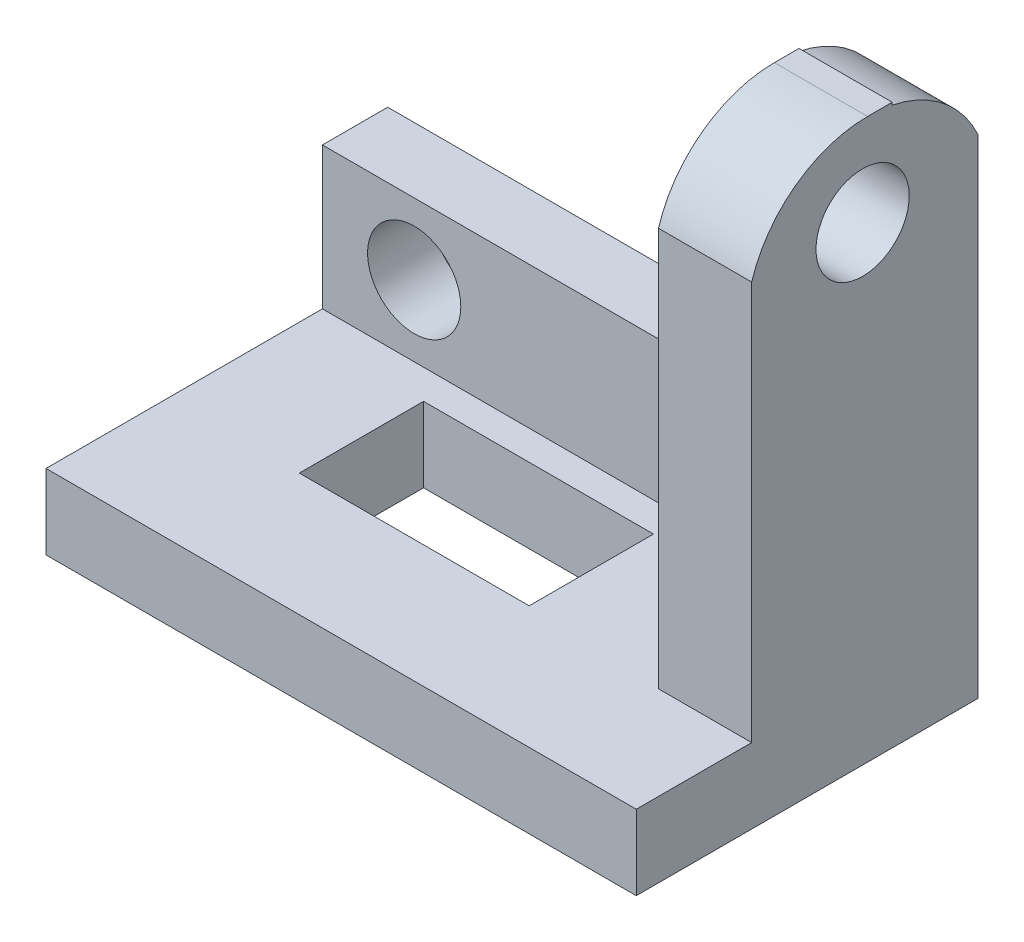
ISO-10303-21;
HEADER;
FILE_DESCRIPTION(('STEP AP214'),'2;1');
FILE_NAME('part.step','',(''),(''),'','','');
FILE_SCHEMA(('AUTOMOTIVE_DESIGN { 1 0 10303 214 1 1 1 1 }'));
ENDSEC;
DATA;
#1=APPLICATION_CONTEXT('core data for automotive mechanical design processes');
#2=APPLICATION_PROTOCOL_DEFINITION('international standard','automotive_design',2000,#1);
#3=PRODUCT_CONTEXT('',#1,'mechanical');
#4=PRODUCT('Part','Part','',(#3));
#5=PRODUCT_RELATED_PRODUCT_CATEGORY('part','',(#4));
#6=PRODUCT_DEFINITION_FORMATION('','',#4);
#7=PRODUCT_DEFINITION_CONTEXT('part definition',#1,'design');
#8=PRODUCT_DEFINITION('design','',#6,#7);
#9=PRODUCT_DEFINITION_SHAPE('','',#8);
#10=(LENGTH_UNIT() NAMED_UNIT(*) SI_UNIT(.MILLI.,.METRE.));
#11=(NAMED_UNIT(*) PLANE_ANGLE_UNIT() SI_UNIT($,.RADIAN.));
#12=(NAMED_UNIT(*) SI_UNIT($,.STERADIAN.) SOLID_ANGLE_UNIT());
#13=UNCERTAINTY_MEASURE_WITH_UNIT(LENGTH_MEASURE(1.E-05),#10,'distance_accuracy_value','');
#14=(GEOMETRIC_REPRESENTATION_CONTEXT(3) GLOBAL_UNCERTAINTY_ASSIGNED_CONTEXT((#13)) GLOBAL_UNIT_ASSIGNED_CONTEXT((#10,
#11,#12)) REPRESENTATION_CONTEXT('',''));
#15=CARTESIAN_POINT('',(0.,0.,0.));
#16=DIRECTION('',(0.,0.,1.));
#17=DIRECTION('',(1.,0.,0.));
#18=AXIS2_PLACEMENT_3D('',#15,#16,#17);
#19=CARTESIAN_POINT('',(0.,0.,0.));
#20=DIRECTION('',(0.,1.,0.));
#21=DIRECTION('',(0.,0.,1.));
#22=AXIS2_PLACEMENT_3D('',#19,#20,#21);
#23=PLANE('',#22);
#24=DIRECTION('',(1.,0.,0.));
#25=VECTOR('',#24,1.);
#26=CARTESIAN_POINT('',(0.,0.,6.71744032632979));
#27=LINE('',#26,#25);
#28=CARTESIAN_POINT('',(41.89111747851,0.,6.71744032632978));
#29=VERTEX_POINT('',#28);
#30=CARTESIAN_POINT('',(56.89111747851,0.,6.71744032632978));
#31=VERTEX_POINT('',#30);
#32=EDGE_CURVE('E340',#29,#31,#27,.T.);
#33=ORIENTED_EDGE('',*,*,#32,.F.);
#34=DIRECTION('',(0.,0.,1.));
#35=VECTOR('',#34,1.);
#36=CARTESIAN_POINT('',(41.89111747851,0.,0.));
#37=LINE('',#36,#35);
#38=CARTESIAN_POINT('',(41.89111747851,0.,10.6759383719178));
#39=VERTEX_POINT('',#38);
#40=EDGE_CURVE('E247',#29,#39,#37,.T.);
#41=ORIENTED_EDGE('',*,*,#40,.T.);
#42=DIRECTION('',(1.,0.,0.));
#43=VECTOR('',#42,1.);
#44=CARTESIAN_POINT('',(-43.10888252149,0.,10.6759383719178));
#45=LINE('',#44,#43);
#46=CARTESIAN_POINT('',(56.89111747851,0.,10.6759383719178));
#47=VERTEX_POINT('',#46);
#48=EDGE_CURVE('E325',#47,#39,#45,.F.);
#49=ORIENTED_EDGE('',*,*,#48,.F.);
#50=DIRECTION('',(0.,0.,-1.));
#51=VECTOR('',#50,1.);
#52=CARTESIAN_POINT('',(56.89111747851,0.,-7.0916905444126));
#53=LINE('',#52,#51);
#54=EDGE_CURVE('E300',#47,#31,#53,.T.);
#55=ORIENTED_EDGE('',*,*,#54,.T.);
#56=EDGE_LOOP('',(#33,#41,#49,#55));
#57=FACE_BOUND('',#56,.T.);
#58=ADVANCED_FACE('F39',(#57),#23,.T.);
#59=CARTESIAN_POINT('',(-43.10888252149,-19.5343296589559,10.6759383719178));
#60=DIRECTION('',(1.,0.,0.));
#61=DIRECTION('',(0.,0.,-1.));
#62=AXIS2_PLACEMENT_3D('',#59,#60,#61);
#63=CYLINDRICAL_SURFACE('',#62,19.5343296589559);
#64=CARTESIAN_POINT('',(41.89111747851,-19.5343296589559,10.6759383719178));
#65=DIRECTION('',(-1.,0.,0.));
#66=DIRECTION('',(0.,0.,1.));
#67=AXIS2_PLACEMENT_3D('',#64,#65,#66);
#68=CIRCLE('',#67,19.5343296589559);
#69=CARTESIAN_POINT('',(41.89111747851,-13.7544634367932,29.3356056165035));
#70=VERTEX_POINT('',#69);
#71=EDGE_CURVE('E254',#70,#39,#68,.T.);
#72=ORIENTED_EDGE('',*,*,#71,.F.);
#73=DIRECTION('',(1.,0.,0.));
#74=VECTOR('',#73,1.);
#75=CARTESIAN_POINT('',(-43.10888252149,-13.7544634367932,29.3356056165036));
#76=LINE('',#75,#74);
#77=CARTESIAN_POINT('',(56.89111747851,-13.7544634367932,29.3356056165035));
#78=VERTEX_POINT('',#77);
#79=EDGE_CURVE('E290',#70,#78,#76,.T.);
#80=ORIENTED_EDGE('',*,*,#79,.T.);
#81=CARTESIAN_POINT('',(56.89111747851,-19.5343296589559,10.6759383719178));
#82=DIRECTION('',(1.,0.,0.));
#83=DIRECTION('',(0.,0.,-1.));
#84=AXIS2_PLACEMENT_3D('',#81,#82,#83);
#85=CIRCLE('',#84,19.5343296589559);
#86=EDGE_CURVE('E283',#78,#47,#85,.F.);
#87=ORIENTED_EDGE('',*,*,#86,.T.);
#88=ORIENTED_EDGE('',*,*,#48,.T.);
#89=EDGE_LOOP('',(#72,#80,#87,#88));
#90=FACE_BOUND('',#89,.T.);
#91=ADVANCED_FACE('F399',(#90),#63,.T.);
#92=CARTESIAN_POINT('',(-43.10888252149,0.,6.7174403263298));
#93=DIRECTION('',(0.,0.,1.));
#94=DIRECTION('',(1.,0.,0.));
#95=AXIS2_PLACEMENT_3D('',#92,#93,#94);
#96=PLANE('',#95);
#97=DIRECTION('',(0.,-1.,0.));
#98=VECTOR('',#97,1.);
#99=CARTESIAN_POINT('',(41.89111747851,0.,6.71744032632978));
#100=LINE('',#99,#98);
#101=CARTESIAN_POINT('',(41.89111747851,-0.405285551948364,6.71744032632978));
#102=VERTEX_POINT('',#101);
#103=EDGE_CURVE('E244',#29,#102,#100,.T.);
#104=ORIENTED_EDGE('',*,*,#103,.F.);
#105=ORIENTED_EDGE('',*,*,#32,.T.);
#106=DIRECTION('',(0.,-1.,0.));
#107=VECTOR('',#106,1.);
#108=CARTESIAN_POINT('',(56.89111747851,0.,6.71744032632978));
#109=LINE('',#108,#107);
#110=CARTESIAN_POINT('',(56.89111747851,-0.405285551948364,6.71744032632978));
#111=VERTEX_POINT('',#110);
#112=EDGE_CURVE('E264',#31,#111,#109,.T.);
#113=ORIENTED_EDGE('',*,*,#112,.T.);
#114=DIRECTION('',(1.,0.,0.));
#115=VECTOR('',#114,1.);
#116=CARTESIAN_POINT('',(-43.10888252149,-0.405285551948364,6.7174403263298));
#117=LINE('',#116,#115);
#118=EDGE_CURVE('E273',#102,#111,#117,.T.);
#119=ORIENTED_EDGE('',*,*,#118,.F.);
#120=EDGE_LOOP('',(#104,#105,#113,#119));
#121=FACE_BOUND('',#120,.T.);
#122=ADVANCED_FACE('F408',(#121),#96,.F.);
#123=CARTESIAN_POINT('',(-43.10888252149,-19.5343296589559,10.6759383719178));
#124=DIRECTION('',(1.,0.,0.));
#125=DIRECTION('',(0.,0.,-1.));
#126=AXIS2_PLACEMENT_3D('',#123,#124,#125);
#127=CYLINDRICAL_SURFACE('',#126,19.5343296589559);
#128=CARTESIAN_POINT('',(41.89111747851,-19.5343296589559,10.6759383719178));
#129=DIRECTION('',(-1.,0.,0.));
#130=DIRECTION('',(0.,0.,1.));
#131=AXIS2_PLACEMENT_3D('',#128,#129,#130);
#132=CIRCLE('',#131,19.5343296589559);
#133=CARTESIAN_POINT('',(41.89111747851,-11.4163620613152,-7.0916905444126));
#134=VERTEX_POINT('',#133);
#135=EDGE_CURVE('E343',#102,#134,#132,.T.);
#136=ORIENTED_EDGE('',*,*,#135,.F.);
#137=ORIENTED_EDGE('',*,*,#118,.T.);
#138=CARTESIAN_POINT('',(56.89111747851,-19.5343296589559,10.6759383719178));
#139=DIRECTION('',(1.,0.,0.));
#140=DIRECTION('',(0.,0.,-1.));
#141=AXIS2_PLACEMENT_3D('',#138,#139,#140);
#142=CIRCLE('',#141,19.5343296589559);
#143=CARTESIAN_POINT('',(56.89111747851,-11.4163620613152,-7.0916905444126));
#144=VERTEX_POINT('',#143);
#145=EDGE_CURVE('E268',#111,#144,#142,.F.);
#146=ORIENTED_EDGE('',*,*,#145,.T.);
#147=DIRECTION('',(1.,0.,0.));
#148=VECTOR('',#147,1.);
#149=CARTESIAN_POINT('',(-43.10888252149,-11.4163620613152,-7.09169054441258));
#150=LINE('',#149,#148);
#151=EDGE_CURVE('E274',#134,#144,#150,.T.);
#152=ORIENTED_EDGE('',*,*,#151,.F.);
#153=EDGE_LOOP('',(#136,#137,#146,#152));
#154=FACE_BOUND('',#153,.T.);
#155=ADVANCED_FACE('F378',(#154),#127,.T.);
#156=CARTESIAN_POINT('',(-38.10888252149,-90.,-7.0916905444126));
#157=DIRECTION('',(-1.,0.,0.));
#158=DIRECTION('',(0.,0.,1.));
#159=AXIS2_PLACEMENT_3D('',#156,#157,#158);
#160=PLANE('',#159);
#161=DIRECTION('',(0.,0.,1.));
#162=VECTOR('',#161,1.);
#163=CARTESIAN_POINT('',(-38.10888252149,-77.9459739271902,-7.0916905444126));
#164=LINE('',#163,#162);
#165=CARTESIAN_POINT('',(-38.10888252149,-77.9459739271902,3.41789142542638));
#166=VERTEX_POINT('',#165);
#167=CARTESIAN_POINT('',(-38.10888252149,-77.9459739271902,47.9083094555874));
#168=VERTEX_POINT('',#167);
#169=EDGE_CURVE('E277',#166,#168,#164,.T.);
#170=ORIENTED_EDGE('',*,*,#169,.F.);
#171=DIRECTION('',(0.,1.,0.));
#172=VECTOR('',#171,1.);
#173=CARTESIAN_POINT('',(-38.10888252149,-162.039540321358,3.41789142542638));
#174=LINE('',#173,#172);
#175=CARTESIAN_POINT('',(-38.10888252149,-55.1004949091123,3.41789142542638));
#176=VERTEX_POINT('',#175);
#177=EDGE_CURVE('E230',#166,#176,#174,.T.);
#178=ORIENTED_EDGE('',*,*,#177,.T.);
#179=DIRECTION('',(0.,0.,1.));
#180=VECTOR('',#179,1.);
#181=CARTESIAN_POINT('',(-38.10888252149,-55.1004949091123,38.1456468001318));
#182=LINE('',#181,#180);
#183=CARTESIAN_POINT('',(-38.10888252149,-55.1004949091123,-7.0916905444126));
#184=VERTEX_POINT('',#183);
#185=EDGE_CURVE('E238',#184,#176,#182,.T.);
#186=ORIENTED_EDGE('',*,*,#185,.F.);
#187=DIRECTION('',(0.,1.,0.));
#188=VECTOR('',#187,1.);
#189=CARTESIAN_POINT('',(-38.10888252149,-90.,-7.0916905444126));
#190=LINE('',#189,#188);
#191=CARTESIAN_POINT('',(-38.10888252149,-90.,-7.0916905444126));
#192=VERTEX_POINT('',#191);
#193=EDGE_CURVE('E321',#192,#184,#190,.T.);
#194=ORIENTED_EDGE('',*,*,#193,.F.);
#195=DIRECTION('',(0.,0.,1.));
#196=VECTOR('',#195,1.);
#197=CARTESIAN_POINT('',(-38.10888252149,-90.,-7.0916905444126));
#198=LINE('',#197,#196);
#199=CARTESIAN_POINT('',(-38.10888252149,-90.,47.9083094555874));
#200=VERTEX_POINT('',#199);
#201=EDGE_CURVE('E301',#192,#200,#198,.T.);
#202=ORIENTED_EDGE('',*,*,#201,.T.);
#203=DIRECTION('',(0.,1.,0.));
#204=VECTOR('',#203,1.);
#205=CARTESIAN_POINT('',(-38.10888252149,-90.,47.9083094555874));
#206=LINE('',#205,#204);
#207=EDGE_CURVE('E317',#200,#168,#206,.T.);
#208=ORIENTED_EDGE('',*,*,#207,.T.);
#209=EDGE_LOOP('',(#170,#178,#186,#194,#202,#208));
#210=FACE_BOUND('',#209,.T.);
#211=ADVANCED_FACE('F391',(#210),#160,.T.);
#212=CARTESIAN_POINT('',(56.89111747851,-90.,-7.0916905444126));
#213=DIRECTION('',(1.,0.,0.));
#214=DIRECTION('',(0.,0.,-1.));
#215=AXIS2_PLACEMENT_3D('',#212,#213,#214);
#216=PLANE('',#215);
#217=CARTESIAN_POINT('',(56.89111747851,-14.3921274482877,11.4810132946713));
#218=DIRECTION('',(1.,0.,0.));
#219=DIRECTION('',(0.,0.,-1.));
#220=AXIS2_PLACEMENT_3D('',#217,#218,#219);
#221=CIRCLE('',#220,7.5);
#222=CARTESIAN_POINT('',(56.89111747851,-14.3921274482877,3.98101329467127));
#223=VERTEX_POINT('',#222);
#224=EDGE_CURVE('E614',#223,#223,#221,.T.);
#225=ORIENTED_EDGE('',*,*,#224,.F.);
#226=EDGE_LOOP('',(#225));
#227=FACE_BOUND('',#226,.T.);
#228=ORIENTED_EDGE('',*,*,#112,.F.);
#229=ORIENTED_EDGE('',*,*,#54,.F.);
#230=ORIENTED_EDGE('',*,*,#86,.F.);
#231=DIRECTION('',(0.,1.,0.));
#232=VECTOR('',#231,1.);
#233=CARTESIAN_POINT('',(56.89111747851,0.,29.3356056165035));
#234=LINE('',#233,#232);
#235=CARTESIAN_POINT('',(56.89111747851,-77.9459739271902,29.3356056165035));
#236=VERTEX_POINT('',#235);
#237=EDGE_CURVE('E263',#236,#78,#234,.T.);
#238=ORIENTED_EDGE('',*,*,#237,.F.);
#239=DIRECTION('',(0.,0.,-1.));
#240=VECTOR('',#239,1.);
#241=CARTESIAN_POINT('',(56.89111747851,-77.9459739271902,0.));
#242=LINE('',#241,#240);
#243=CARTESIAN_POINT('',(56.89111747851,-77.9459739271902,47.9083094555874));
#244=VERTEX_POINT('',#243);
#245=EDGE_CURVE('E286',#244,#236,#242,.T.);
#246=ORIENTED_EDGE('',*,*,#245,.F.);
#247=DIRECTION('',(0.,1.,0.));
#248=VECTOR('',#247,1.);
#249=CARTESIAN_POINT('',(56.89111747851,-90.,47.9083094555874));
#250=LINE('',#249,#248);
#251=CARTESIAN_POINT('',(56.89111747851,-90.,47.9083094555874));
#252=VERTEX_POINT('',#251);
#253=EDGE_CURVE('E330',#252,#244,#250,.T.);
#254=ORIENTED_EDGE('',*,*,#253,.F.);
#255=DIRECTION('',(0.,0.,-1.));
#256=VECTOR('',#255,1.);
#257=CARTESIAN_POINT('',(56.89111747851,-90.,-7.0916905444126));
#258=LINE('',#257,#256);
#259=CARTESIAN_POINT('',(56.89111747851,-90.,-7.0916905444126));
#260=VERTEX_POINT('',#259);
#261=EDGE_CURVE('E309',#252,#260,#258,.T.);
#262=ORIENTED_EDGE('',*,*,#261,.T.);
#263=DIRECTION('',(0.,1.,0.));
#264=VECTOR('',#263,1.);
#265=CARTESIAN_POINT('',(56.89111747851,-90.,-7.0916905444126));
#266=LINE('',#265,#264);
#267=EDGE_CURVE('E326',#260,#144,#266,.T.);
#268=ORIENTED_EDGE('',*,*,#267,.T.);
#269=ORIENTED_EDGE('',*,*,#145,.F.);
#270=EDGE_LOOP('',(#228,#229,#230,#238,#246,#254,#262,#268,#269));
#271=FACE_BOUND('',#270,.T.);
#272=ADVANCED_FACE('F384',(#227,#271),#216,.T.);
#273=CARTESIAN_POINT('',(-38.10888252149,-90.,-7.0916905444126));
#274=DIRECTION('',(0.,0.,-1.));
#275=DIRECTION('',(-1.,0.,0.));
#276=AXIS2_PLACEMENT_3D('',#273,#274,#275);
#277=PLANE('',#276);
#278=CARTESIAN_POINT('',(-23.3423017781825,-66.5232344181512,-7.0916905444126));
#279=DIRECTION('',(0.,0.,-1.));
#280=DIRECTION('',(-1.,0.,0.));
#281=AXIS2_PLACEMENT_3D('',#278,#279,#280);
#282=CIRCLE('',#281,7.5);
#283=CARTESIAN_POINT('',(-30.8423017781825,-66.5232344181512,-7.0916905444126));
#284=VERTEX_POINT('',#283);
#285=EDGE_CURVE('E218',#284,#284,#282,.T.);
#286=ORIENTED_EDGE('',*,*,#285,.F.);
#287=EDGE_LOOP('',(#286));
#288=FACE_BOUND('',#287,.T.);
#289=CARTESIAN_POINT('',(27.0331551298443,-66.5232344181512,-7.0916905444126));
#290=DIRECTION('',(0.,0.,-1.));
#291=DIRECTION('',(-1.,0.,0.));
#292=AXIS2_PLACEMENT_3D('',#289,#290,#291);
#293=CIRCLE('',#292,7.5);
#294=CARTESIAN_POINT('',(19.5331551298443,-66.5232344181512,-7.0916905444126));
#295=VERTEX_POINT('',#294);
#296=EDGE_CURVE('E211',#295,#295,#293,.T.);
#297=ORIENTED_EDGE('',*,*,#296,.F.);
#298=EDGE_LOOP('',(#297));
#299=FACE_BOUND('',#298,.T.);
#300=DIRECTION('',(-1.,0.,0.));
#301=VECTOR('',#300,1.);
#302=CARTESIAN_POINT('',(-38.10888252149,-55.1004949091123,-7.0916905444126));
#303=LINE('',#302,#301);
#304=CARTESIAN_POINT('',(21.89111747851,-55.1004949091123,-7.0916905444126));
#305=VERTEX_POINT('',#304);
#306=EDGE_CURVE('E260',#305,#184,#303,.T.);
#307=ORIENTED_EDGE('',*,*,#306,.F.);
#308=CARTESIAN_POINT('',(21.89111747851,-35.1004949091123,-7.0916905444126));
#309=DIRECTION('',(0.,0.,-1.));
#310=DIRECTION('',(-1.,0.,0.));
#311=AXIS2_PLACEMENT_3D('',#308,#309,#310);
#312=CIRCLE('',#311,20.);
#313=CARTESIAN_POINT('',(41.89111747851,-35.1004949091123,-7.0916905444126));
#314=VERTEX_POINT('',#313);
#315=EDGE_CURVE('E11',#305,#314,#312,.F.);
#316=ORIENTED_EDGE('',*,*,#315,.T.);
#317=DIRECTION('',(0.,1.,0.));
#318=VECTOR('',#317,1.);
#319=CARTESIAN_POINT('',(41.89111747851,-90.,-7.0916905444126));
#320=LINE('',#319,#318);
#321=EDGE_CURVE('E251',#314,#134,#320,.T.);
#322=ORIENTED_EDGE('',*,*,#321,.T.);
#323=ORIENTED_EDGE('',*,*,#151,.T.);
#324=ORIENTED_EDGE('',*,*,#267,.F.);
#325=DIRECTION('',(-1.,0.,0.));
#326=VECTOR('',#325,1.);
#327=CARTESIAN_POINT('',(-38.10888252149,-90.,-7.0916905444126));
#328=LINE('',#327,#326);
#329=EDGE_CURVE('E313',#260,#192,#328,.T.);
#330=ORIENTED_EDGE('',*,*,#329,.T.);
#331=ORIENTED_EDGE('',*,*,#193,.T.);
#332=EDGE_LOOP('',(#307,#316,#322,#323,#324,#330,#331));
#333=FACE_BOUND('',#332,.T.);
#334=ADVANCED_FACE('F370',(#288,#299,#333),#277,.T.);
#335=CARTESIAN_POINT('',(-38.10888252149,-90.,47.9083094555874));
#336=DIRECTION('',(0.,0.,1.));
#337=DIRECTION('',(1.,0.,0.));
#338=AXIS2_PLACEMENT_3D('',#335,#336,#337);
#339=PLANE('',#338);
#340=DIRECTION('',(1.,0.,0.));
#341=VECTOR('',#340,1.);
#342=CARTESIAN_POINT('',(-43.10888252149,-77.9459739271902,47.9083094555874));
#343=LINE('',#342,#341);
#344=EDGE_CURVE('E293',#168,#244,#343,.T.);
#345=ORIENTED_EDGE('',*,*,#344,.F.);
#346=ORIENTED_EDGE('',*,*,#207,.F.);
#347=DIRECTION('',(1.,0.,0.));
#348=VECTOR('',#347,1.);
#349=CARTESIAN_POINT('',(-38.10888252149,-90.,47.9083094555874));
#350=LINE('',#349,#348);
#351=EDGE_CURVE('E305',#200,#252,#350,.T.);
#352=ORIENTED_EDGE('',*,*,#351,.T.);
#353=ORIENTED_EDGE('',*,*,#253,.T.);
#354=EDGE_LOOP('',(#345,#346,#352,#353));
#355=FACE_BOUND('',#354,.T.);
#356=ADVANCED_FACE('F427',(#355),#339,.T.);
#357=CARTESIAN_POINT('',(0.,-90.,0.));
#358=DIRECTION('',(0.,1.,0.));
#359=DIRECTION('',(0.,0.,1.));
#360=AXIS2_PLACEMENT_3D('',#357,#358,#359);
#361=PLANE('',#360);
#362=DIRECTION('',(-1.,0.,0.));
#363=VECTOR('',#362,1.);
#364=CARTESIAN_POINT('',(0.,-90.,8.17209526165243));
#365=LINE('',#364,#363);
#366=CARTESIAN_POINT('',(19.9217850816576,-90.,8.17209526165243));
#367=VERTEX_POINT('',#366);
#368=CARTESIAN_POINT('',(-17.0782149183424,-90.,8.17209526165243));
#369=VERTEX_POINT('',#368);
#370=EDGE_CURVE('E198',#367,#369,#365,.T.);
#371=ORIENTED_EDGE('',*,*,#370,.T.);
#372=DIRECTION('',(0.,0.,1.));
#373=VECTOR('',#372,1.);
#374=CARTESIAN_POINT('',(-17.0782149183424,-90.,0.));
#375=LINE('',#374,#373);
#376=CARTESIAN_POINT('',(-17.0782149183424,-90.,28.1720952616524));
#377=VERTEX_POINT('',#376);
#378=EDGE_CURVE('E202',#369,#377,#375,.T.);
#379=ORIENTED_EDGE('',*,*,#378,.T.);
#380=DIRECTION('',(1.,0.,0.));
#381=VECTOR('',#380,1.);
#382=CARTESIAN_POINT('',(0.,-90.,28.1720952616524));
#383=LINE('',#382,#381);
#384=CARTESIAN_POINT('',(19.9217850816576,-90.,28.1720952616524));
#385=VERTEX_POINT('',#384);
#386=EDGE_CURVE('E189',#377,#385,#383,.T.);
#387=ORIENTED_EDGE('',*,*,#386,.T.);
#388=DIRECTION('',(0.,0.,-1.));
#389=VECTOR('',#388,1.);
#390=CARTESIAN_POINT('',(19.9217850816576,-90.,0.));
#391=LINE('',#390,#389);
#392=EDGE_CURVE('E164',#385,#367,#391,.T.);
#393=ORIENTED_EDGE('',*,*,#392,.T.);
#394=EDGE_LOOP('',(#371,#379,#387,#393));
#395=FACE_BOUND('',#394,.T.);
#396=ORIENTED_EDGE('',*,*,#201,.F.);
#397=ORIENTED_EDGE('',*,*,#329,.F.);
#398=ORIENTED_EDGE('',*,*,#261,.F.);
#399=ORIENTED_EDGE('',*,*,#351,.F.);
#400=EDGE_LOOP('',(#396,#397,#398,#399));
#401=FACE_BOUND('',#400,.T.);
#402=ADVANCED_FACE('F389',(#395,#401),#361,.F.);
#403=CARTESIAN_POINT('',(-43.10888252149,0.,29.3356056165036));
#404=DIRECTION('',(0.,0.,-1.));
#405=DIRECTION('',(-1.,0.,0.));
#406=AXIS2_PLACEMENT_3D('',#403,#404,#405);
#407=PLANE('',#406);
#408=DIRECTION('',(0.,1.,0.));
#409=VECTOR('',#408,1.);
#410=CARTESIAN_POINT('',(41.89111747851,0.,29.3356056165035));
#411=LINE('',#410,#409);
#412=CARTESIAN_POINT('',(41.89111747851,-77.9459739271902,29.3356056165035));
#413=VERTEX_POINT('',#412);
#414=EDGE_CURVE('E257',#413,#70,#411,.T.);
#415=ORIENTED_EDGE('',*,*,#414,.F.);
#416=DIRECTION('',(1.,0.,0.));
#417=VECTOR('',#416,1.);
#418=CARTESIAN_POINT('',(-43.10888252149,-77.9459739271902,29.3356056165036));
#419=LINE('',#418,#417);
#420=EDGE_CURVE('E269',#413,#236,#419,.T.);
#421=ORIENTED_EDGE('',*,*,#420,.T.);
#422=ORIENTED_EDGE('',*,*,#237,.T.);
#423=ORIENTED_EDGE('',*,*,#79,.F.);
#424=EDGE_LOOP('',(#415,#421,#422,#423));
#425=FACE_BOUND('',#424,.T.);
#426=ADVANCED_FACE('F401',(#425),#407,.F.);
#427=CARTESIAN_POINT('',(-43.10888252149,-77.9459739271902,0.));
#428=DIRECTION('',(0.,-1.,0.));
#429=DIRECTION('',(0.,0.,-1.));
#430=AXIS2_PLACEMENT_3D('',#427,#428,#429);
#431=PLANE('',#430);
#432=DIRECTION('',(1.,0.,0.));
#433=VECTOR('',#432,1.);
#434=CARTESIAN_POINT('',(-17.0782149183424,-77.9459739271902,28.1720952616524));
#435=LINE('',#434,#433);
#436=CARTESIAN_POINT('',(-17.0782149183424,-77.9459739271902,28.1720952616524));
#437=VERTEX_POINT('',#436);
#438=CARTESIAN_POINT('',(19.9217850816576,-77.9459739271902,28.1720952616524));
#439=VERTEX_POINT('',#438);
#440=EDGE_CURVE('E171',#437,#439,#435,.T.);
#441=ORIENTED_EDGE('',*,*,#440,.F.);
#442=DIRECTION('',(0.,0.,1.));
#443=VECTOR('',#442,1.);
#444=CARTESIAN_POINT('',(-17.0782149183424,-77.9459739271902,8.17209526165243));
#445=LINE('',#444,#443);
#446=CARTESIAN_POINT('',(-17.0782149183424,-77.9459739271902,8.17209526165243));
#447=VERTEX_POINT('',#446);
#448=EDGE_CURVE('E63',#447,#437,#445,.T.);
#449=ORIENTED_EDGE('',*,*,#448,.F.);
#450=DIRECTION('',(-1.,0.,0.));
#451=VECTOR('',#450,1.);
#452=CARTESIAN_POINT('',(-17.0782149183424,-77.9459739271902,8.17209526165243));
#453=LINE('',#452,#451);
#454=CARTESIAN_POINT('',(19.9217850816576,-77.9459739271902,8.17209526165243));
#455=VERTEX_POINT('',#454);
#456=EDGE_CURVE('E179',#455,#447,#453,.T.);
#457=ORIENTED_EDGE('',*,*,#456,.F.);
#458=DIRECTION('',(0.,0.,-1.));
#459=VECTOR('',#458,1.);
#460=CARTESIAN_POINT('',(19.9217850816576,-77.9459739271902,8.17209526165243));
#461=LINE('',#460,#459);
#462=EDGE_CURVE('E161',#439,#455,#461,.T.);
#463=ORIENTED_EDGE('',*,*,#462,.F.);
#464=EDGE_LOOP('',(#441,#449,#457,#463));
#465=FACE_BOUND('',#464,.T.);
#466=ORIENTED_EDGE('',*,*,#169,.T.);
#467=ORIENTED_EDGE('',*,*,#344,.T.);
#468=ORIENTED_EDGE('',*,*,#245,.T.);
#469=ORIENTED_EDGE('',*,*,#420,.F.);
#470=DIRECTION('',(0.,0.,-1.));
#471=VECTOR('',#470,1.);
#472=CARTESIAN_POINT('',(41.89111747851,-77.9459739271902,3.41789142542638));
#473=LINE('',#472,#471);
#474=CARTESIAN_POINT('',(41.89111747851,-77.9459739271902,3.41789142542638));
#475=VERTEX_POINT('',#474);
#476=EDGE_CURVE('E225',#413,#475,#473,.T.);
#477=ORIENTED_EDGE('',*,*,#476,.T.);
#478=DIRECTION('',(-1.,0.,0.));
#479=VECTOR('',#478,1.);
#480=CARTESIAN_POINT('',(-38.10888252149,-77.9459739271902,3.41789142542638));
#481=LINE('',#480,#479);
#482=EDGE_CURVE('E226',#475,#166,#481,.T.);
#483=ORIENTED_EDGE('',*,*,#482,.T.);
#484=EDGE_LOOP('',(#466,#467,#468,#469,#477,#483));
#485=FACE_BOUND('',#484,.T.);
#486=ADVANCED_FACE('F176',(#465,#485),#431,.F.);
#487=CARTESIAN_POINT('',(41.89111747851,-55.1004949091123,38.1456468001318));
#488=DIRECTION('',(0.,-1.,0.));
#489=DIRECTION('',(0.,0.,-1.));
#490=AXIS2_PLACEMENT_3D('',#487,#488,#489);
#491=PLANE('',#490);
#492=DIRECTION('',(-1.,0.,0.));
#493=VECTOR('',#492,1.);
#494=CARTESIAN_POINT('',(-38.10888252149,-55.1004949091123,3.41789142542638));
#495=LINE('',#494,#493);
#496=CARTESIAN_POINT('',(21.89111747851,-55.1004949091123,3.41789142542638));
#497=VERTEX_POINT('',#496);
#498=EDGE_CURVE('E222',#497,#176,#495,.T.);
#499=ORIENTED_EDGE('',*,*,#498,.F.);
#500=DIRECTION('',(0.,0.,1.));
#501=VECTOR('',#500,1.);
#502=CARTESIAN_POINT('',(21.89111747851,-55.1004949091123,38.1456468001318));
#503=LINE('',#502,#501);
#504=EDGE_CURVE('E351',#497,#305,#503,.F.);
#505=ORIENTED_EDGE('',*,*,#504,.T.);
#506=ORIENTED_EDGE('',*,*,#306,.T.);
#507=ORIENTED_EDGE('',*,*,#185,.T.);
#508=EDGE_LOOP('',(#499,#505,#506,#507));
#509=FACE_BOUND('',#508,.T.);
#510=ADVANCED_FACE('F364',(#509),#491,.F.);
#511=CARTESIAN_POINT('',(41.89111747851,0.,0.));
#512=DIRECTION('',(-1.,0.,0.));
#513=DIRECTION('',(0.,0.,1.));
#514=AXIS2_PLACEMENT_3D('',#511,#512,#513);
#515=PLANE('',#514);
#516=CARTESIAN_POINT('',(41.89111747851,-14.3921274482877,11.4810132946713));
#517=DIRECTION('',(-1.,0.,0.));
#518=DIRECTION('',(0.,0.,1.));
#519=AXIS2_PLACEMENT_3D('',#516,#517,#518);
#520=CIRCLE('',#519,7.5);
#521=CARTESIAN_POINT('',(41.89111747851,-14.3921274482877,18.9810132946713));
#522=VERTEX_POINT('',#521);
#523=EDGE_CURVE('E617',#522,#522,#520,.T.);
#524=ORIENTED_EDGE('',*,*,#523,.F.);
#525=EDGE_LOOP('',(#524));
#526=FACE_BOUND('',#525,.T.);
#527=ORIENTED_EDGE('',*,*,#321,.F.);
#528=DIRECTION('',(0.,0.,1.));
#529=VECTOR('',#528,1.);
#530=CARTESIAN_POINT('',(41.89111747851,-35.1004949091123,0.));
#531=LINE('',#530,#529);
#532=CARTESIAN_POINT('',(41.89111747851,-35.1004949091123,3.41789142542638));
#533=VERTEX_POINT('',#532);
#534=EDGE_CURVE('E347',#314,#533,#531,.T.);
#535=ORIENTED_EDGE('',*,*,#534,.T.);
#536=DIRECTION('',(0.,1.,0.));
#537=VECTOR('',#536,1.);
#538=CARTESIAN_POINT('',(41.89111747851,-162.039540321358,3.41789142542638));
#539=LINE('',#538,#537);
#540=EDGE_CURVE('E231',#475,#533,#539,.T.);
#541=ORIENTED_EDGE('',*,*,#540,.F.);
#542=ORIENTED_EDGE('',*,*,#476,.F.);
#543=ORIENTED_EDGE('',*,*,#414,.T.);
#544=ORIENTED_EDGE('',*,*,#71,.T.);
#545=ORIENTED_EDGE('',*,*,#40,.F.);
#546=ORIENTED_EDGE('',*,*,#103,.T.);
#547=ORIENTED_EDGE('',*,*,#135,.T.);
#548=EDGE_LOOP('',(#527,#535,#541,#542,#543,#544,#545,#546,#547));
#549=FACE_BOUND('',#548,.T.);
#550=ADVANCED_FACE('F372',(#526,#549),#515,.T.);
#551=CARTESIAN_POINT('',(-38.10888252149,-162.039540321358,3.41789142542638));
#552=DIRECTION('',(0.,0.,-1.));
#553=DIRECTION('',(-1.,0.,0.));
#554=AXIS2_PLACEMENT_3D('',#551,#552,#553);
#555=PLANE('',#554);
#556=CARTESIAN_POINT('',(-23.3423017781825,-66.5232344181512,3.41789142542638));
#557=DIRECTION('',(0.,0.,1.));
#558=DIRECTION('',(1.,0.,0.));
#559=AXIS2_PLACEMENT_3D('',#556,#557,#558);
#560=CIRCLE('',#559,7.5);
#561=CARTESIAN_POINT('',(-15.8423017781825,-66.5232344181512,3.41789142542638));
#562=VERTEX_POINT('',#561);
#563=EDGE_CURVE('E207',#562,#562,#560,.T.);
#564=ORIENTED_EDGE('',*,*,#563,.F.);
#565=EDGE_LOOP('',(#564));
#566=FACE_BOUND('',#565,.T.);
#567=CARTESIAN_POINT('',(27.0331551298443,-66.5232344181512,3.41789142542638));
#568=DIRECTION('',(0.,0.,1.));
#569=DIRECTION('',(1.,0.,0.));
#570=AXIS2_PLACEMENT_3D('',#567,#568,#569);
#571=CIRCLE('',#570,7.5);
#572=CARTESIAN_POINT('',(34.5331551298443,-66.5232344181512,3.41789142542638));
#573=VERTEX_POINT('',#572);
#574=EDGE_CURVE('E206',#573,#573,#571,.T.);
#575=ORIENTED_EDGE('',*,*,#574,.F.);
#576=EDGE_LOOP('',(#575));
#577=FACE_BOUND('',#576,.T.);
#578=ORIENTED_EDGE('',*,*,#540,.T.);
#579=CARTESIAN_POINT('',(21.89111747851,-35.1004949091123,3.41789142542638));
#580=DIRECTION('',(0.,0.,-1.));
#581=DIRECTION('',(-1.,0.,0.));
#582=AXIS2_PLACEMENT_3D('',#579,#580,#581);
#583=CIRCLE('',#582,20.);
#584=EDGE_CURVE('E48',#533,#497,#583,.T.);
#585=ORIENTED_EDGE('',*,*,#584,.T.);
#586=ORIENTED_EDGE('',*,*,#498,.T.);
#587=ORIENTED_EDGE('',*,*,#177,.F.);
#588=ORIENTED_EDGE('',*,*,#482,.F.);
#589=EDGE_LOOP('',(#578,#585,#586,#587,#588));
#590=FACE_BOUND('',#589,.T.);
#591=ADVANCED_FACE('F357',(#566,#577,#590),#555,.F.);
#592=CARTESIAN_POINT('',(21.89111747851,-35.1004949091123,0.));
#593=DIRECTION('',(0.,0.,1.));
#594=DIRECTION('',(1.,0.,0.));
#595=AXIS2_PLACEMENT_3D('',#592,#593,#594);
#596=CYLINDRICAL_SURFACE('',#595,20.);
#597=ORIENTED_EDGE('',*,*,#315,.F.);
#598=ORIENTED_EDGE('',*,*,#504,.F.);
#599=ORIENTED_EDGE('',*,*,#584,.F.);
#600=ORIENTED_EDGE('',*,*,#534,.F.);
#601=EDGE_LOOP('',(#597,#598,#599,#600));
#602=FACE_BOUND('',#601,.T.);
#603=ADVANCED_FACE('F41',(#602),#596,.F.);
#604=CARTESIAN_POINT('',(27.0331551298443,-66.5232344181512,-26.5821085745736));
#605=DIRECTION('',(0.,0.,1.));
#606=DIRECTION('',(1.,0.,0.));
#607=AXIS2_PLACEMENT_3D('',#604,#605,#606);
#608=CYLINDRICAL_SURFACE('',#607,7.5);
#609=ORIENTED_EDGE('',*,*,#296,.T.);
#610=EDGE_LOOP('',(#609));
#611=FACE_BOUND('',#610,.T.);
#612=ORIENTED_EDGE('',*,*,#574,.T.);
#613=EDGE_LOOP('',(#612));
#614=FACE_BOUND('',#613,.T.);
#615=ADVANCED_FACE('F498',(#611,#614),#608,.F.);
#616=CARTESIAN_POINT('',(-23.3423017781825,-66.5232344181512,-26.5821085745736));
#617=DIRECTION('',(0.,0.,1.));
#618=DIRECTION('',(1.,0.,0.));
#619=AXIS2_PLACEMENT_3D('',#616,#617,#618);
#620=CYLINDRICAL_SURFACE('',#619,7.5);
#621=ORIENTED_EDGE('',*,*,#285,.T.);
#622=EDGE_LOOP('',(#621));
#623=FACE_BOUND('',#622,.T.);
#624=ORIENTED_EDGE('',*,*,#563,.T.);
#625=EDGE_LOOP('',(#624));
#626=FACE_BOUND('',#625,.T.);
#627=ADVANCED_FACE('F503',(#623,#626),#620,.F.);
#628=CARTESIAN_POINT('',(-17.0782149183424,-107.94597392719,8.17209526165243));
#629=DIRECTION('',(-1.,0.,0.));
#630=DIRECTION('',(0.,0.,1.));
#631=AXIS2_PLACEMENT_3D('',#628,#629,#630);
#632=PLANE('',#631);
#633=DIRECTION('',(0.,1.,0.));
#634=VECTOR('',#633,1.);
#635=CARTESIAN_POINT('',(-17.0782149183424,-107.94597392719,8.17209526165243));
#636=LINE('',#635,#634);
#637=EDGE_CURVE('E186',#369,#447,#636,.T.);
#638=ORIENTED_EDGE('',*,*,#637,.T.);
#639=ORIENTED_EDGE('',*,*,#448,.T.);
#640=DIRECTION('',(0.,1.,0.));
#641=VECTOR('',#640,1.);
#642=CARTESIAN_POINT('',(-17.0782149183424,-107.94597392719,28.1720952616524));
#643=LINE('',#642,#641);
#644=EDGE_CURVE('E168',#377,#437,#643,.T.);
#645=ORIENTED_EDGE('',*,*,#644,.F.);
#646=ORIENTED_EDGE('',*,*,#378,.F.);
#647=EDGE_LOOP('',(#638,#639,#645,#646));
#648=FACE_BOUND('',#647,.T.);
#649=ADVANCED_FACE('F510',(#648),#632,.F.);
#650=CARTESIAN_POINT('',(-17.0782149183424,-107.94597392719,8.17209526165243));
#651=DIRECTION('',(0.,0.,-1.));
#652=DIRECTION('',(-1.,0.,0.));
#653=AXIS2_PLACEMENT_3D('',#650,#651,#652);
#654=PLANE('',#653);
#655=DIRECTION('',(0.,1.,0.));
#656=VECTOR('',#655,1.);
#657=CARTESIAN_POINT('',(19.9217850816576,-107.94597392719,8.17209526165243));
#658=LINE('',#657,#656);
#659=EDGE_CURVE('E167',#367,#455,#658,.T.);
#660=ORIENTED_EDGE('',*,*,#659,.T.);
#661=ORIENTED_EDGE('',*,*,#456,.T.);
#662=ORIENTED_EDGE('',*,*,#637,.F.);
#663=ORIENTED_EDGE('',*,*,#370,.F.);
#664=EDGE_LOOP('',(#660,#661,#662,#663));
#665=FACE_BOUND('',#664,.T.);
#666=ADVANCED_FACE('F517',(#665),#654,.F.);
#667=CARTESIAN_POINT('',(19.9217850816576,-107.94597392719,8.17209526165243));
#668=DIRECTION('',(1.,0.,0.));
#669=DIRECTION('',(0.,0.,-1.));
#670=AXIS2_PLACEMENT_3D('',#667,#668,#669);
#671=PLANE('',#670);
#672=DIRECTION('',(0.,1.,0.));
#673=VECTOR('',#672,1.);
#674=CARTESIAN_POINT('',(19.9217850816576,-107.94597392719,28.1720952616524));
#675=LINE('',#674,#673);
#676=EDGE_CURVE('E55',#385,#439,#675,.T.);
#677=ORIENTED_EDGE('',*,*,#676,.T.);
#678=ORIENTED_EDGE('',*,*,#462,.T.);
#679=ORIENTED_EDGE('',*,*,#659,.F.);
#680=ORIENTED_EDGE('',*,*,#392,.F.);
#681=EDGE_LOOP('',(#677,#678,#679,#680));
#682=FACE_BOUND('',#681,.T.);
#683=ADVANCED_FACE('F158',(#682),#671,.F.);
#684=CARTESIAN_POINT('',(-17.0782149183424,-107.94597392719,28.1720952616524));
#685=DIRECTION('',(0.,0.,1.));
#686=DIRECTION('',(1.,0.,0.));
#687=AXIS2_PLACEMENT_3D('',#684,#685,#686);
#688=PLANE('',#687);
#689=ORIENTED_EDGE('',*,*,#644,.T.);
#690=ORIENTED_EDGE('',*,*,#440,.T.);
#691=ORIENTED_EDGE('',*,*,#676,.F.);
#692=ORIENTED_EDGE('',*,*,#386,.F.);
#693=EDGE_LOOP('',(#689,#690,#691,#692));
#694=FACE_BOUND('',#693,.T.);
#695=ADVANCED_FACE('F172',(#694),#688,.F.);
#696=CARTESIAN_POINT('',(71.89111747851,-14.3921274482877,11.4810132946713));
#697=DIRECTION('',(-1.,0.,0.));
#698=DIRECTION('',(0.,0.,1.));
#699=AXIS2_PLACEMENT_3D('',#696,#697,#698);
#700=CYLINDRICAL_SURFACE('',#699,7.5);
#701=ORIENTED_EDGE('',*,*,#224,.T.);
#702=EDGE_LOOP('',(#701));
#703=FACE_BOUND('',#702,.T.);
#704=ORIENTED_EDGE('',*,*,#523,.T.);
#705=EDGE_LOOP('',(#704));
#706=FACE_BOUND('',#705,.T.);
#707=ADVANCED_FACE('F536',(#703,#706),#700,.F.);
#708=CLOSED_SHELL('',(#58,#91,#122,#155,#211,#272,#334,#356,#402,#426,#486,#510,#550,#591,#603,
#615,#627,#649,#666,#683,#695,#707));
#709=MANIFOLD_SOLID_BREP('B2',#708);
#710=ADVANCED_BREP_SHAPE_REPRESENTATION('',(#18,#709),#14);
#711=SHAPE_DEFINITION_REPRESENTATION(#9,#710);
ENDSEC;
END-ISO-10303-21;
